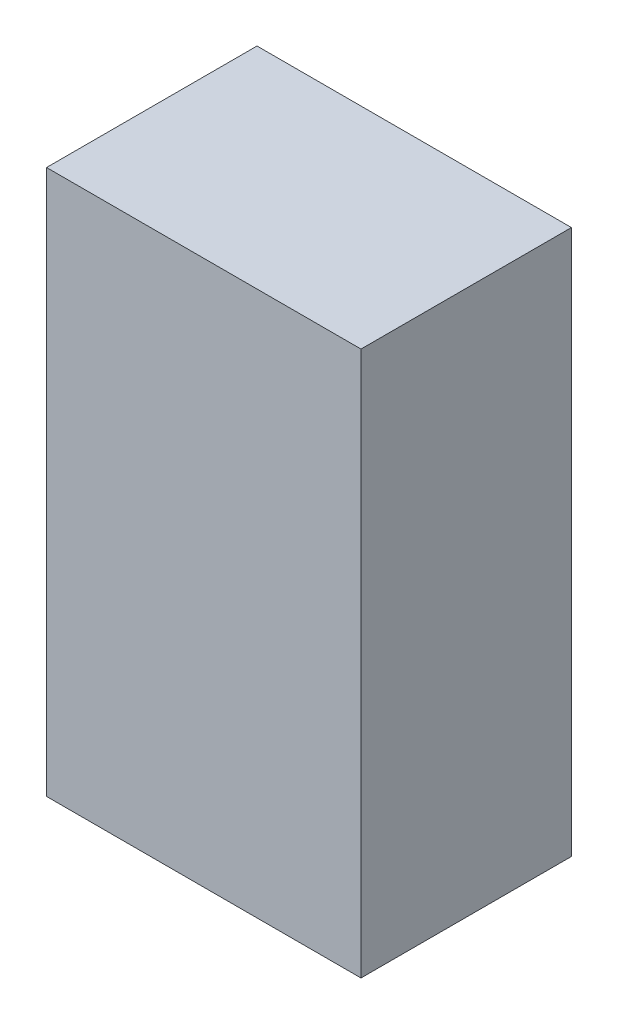
ISO-10303-21;
HEADER;
FILE_DESCRIPTION(('STEP AP214'),'2;1');
FILE_NAME('part.step','',(''),(''),'','','');
FILE_SCHEMA(('AUTOMOTIVE_DESIGN { 1 0 10303 214 1 1 1 1 }'));
ENDSEC;
DATA;
#1=APPLICATION_CONTEXT('core data for automotive mechanical design processes');
#2=APPLICATION_PROTOCOL_DEFINITION('international standard','automotive_design',2000,#1);
#3=PRODUCT_CONTEXT('',#1,'mechanical');
#4=PRODUCT('Part','Part','',(#3));
#5=PRODUCT_RELATED_PRODUCT_CATEGORY('part','',(#4));
#6=PRODUCT_DEFINITION_FORMATION('','',#4);
#7=PRODUCT_DEFINITION_CONTEXT('part definition',#1,'design');
#8=PRODUCT_DEFINITION('design','',#6,#7);
#9=PRODUCT_DEFINITION_SHAPE('','',#8);
#10=(LENGTH_UNIT() NAMED_UNIT(*) SI_UNIT(.MILLI.,.METRE.));
#11=(NAMED_UNIT(*) PLANE_ANGLE_UNIT() SI_UNIT($,.RADIAN.));
#12=(NAMED_UNIT(*) SI_UNIT($,.STERADIAN.) SOLID_ANGLE_UNIT());
#13=UNCERTAINTY_MEASURE_WITH_UNIT(LENGTH_MEASURE(1.E-05),#10,'distance_accuracy_value','');
#14=(GEOMETRIC_REPRESENTATION_CONTEXT(3) GLOBAL_UNCERTAINTY_ASSIGNED_CONTEXT((#13)) GLOBAL_UNIT_ASSIGNED_CONTEXT((#10,
#11,#12)) REPRESENTATION_CONTEXT('',''));
#15=CARTESIAN_POINT('',(0.,0.,0.));
#16=DIRECTION('',(0.,0.,1.));
#17=DIRECTION('',(1.,0.,0.));
#18=AXIS2_PLACEMENT_3D('',#15,#16,#17);
#19=CARTESIAN_POINT('',(0.635,-1.10000034,0.85));
#20=DIRECTION('',(0.,0.,1.));
#21=DIRECTION('',(1.,0.,0.));
#22=AXIS2_PLACEMENT_3D('',#19,#20,#21);
#23=PLANE('',#22);
#24=DIRECTION('',(0.,1.,0.));
#25=VECTOR('',#24,1.);
#26=CARTESIAN_POINT('',(-0.635,-1.10000034,0.85));
#27=LINE('',#26,#25);
#28=CARTESIAN_POINT('',(-0.635,-1.10000034,0.85));
#29=VERTEX_POINT('',#28);
#30=CARTESIAN_POINT('',(-0.635,1.10000034,0.85));
#31=VERTEX_POINT('',#30);
#32=EDGE_CURVE('E53',#29,#31,#27,.T.);
#33=ORIENTED_EDGE('',*,*,#32,.F.);
#34=DIRECTION('',(1.,0.,0.));
#35=VECTOR('',#34,1.);
#36=CARTESIAN_POINT('',(0.635,-1.10000034,0.85));
#37=LINE('',#36,#35);
#38=CARTESIAN_POINT('',(0.635,-1.10000034,0.85));
#39=VERTEX_POINT('',#38);
#40=EDGE_CURVE('E20',#29,#39,#37,.T.);
#41=ORIENTED_EDGE('',*,*,#40,.T.);
#42=DIRECTION('',(0.,1.,0.));
#43=VECTOR('',#42,1.);
#44=CARTESIAN_POINT('',(0.635,1.10000034,0.85));
#45=LINE('',#44,#43);
#46=CARTESIAN_POINT('',(0.635,1.10000034,0.85));
#47=VERTEX_POINT('',#46);
#48=EDGE_CURVE('E67',#47,#39,#45,.F.);
#49=ORIENTED_EDGE('',*,*,#48,.F.);
#50=DIRECTION('',(1.,0.,0.));
#51=VECTOR('',#50,1.);
#52=CARTESIAN_POINT('',(-0.635,1.10000034,0.85));
#53=LINE('',#52,#51);
#54=EDGE_CURVE('E58',#31,#47,#53,.T.);
#55=ORIENTED_EDGE('',*,*,#54,.F.);
#56=EDGE_LOOP('',(#33,#41,#49,#55));
#57=FACE_BOUND('',#56,.T.);
#58=ADVANCED_FACE('F17',(#57),#23,.T.);
#59=CARTESIAN_POINT('',(0.635,1.10000034,0.));
#60=DIRECTION('',(1.,0.,0.));
#61=DIRECTION('',(0.,0.,-1.));
#62=AXIS2_PLACEMENT_3D('',#59,#60,#61);
#63=PLANE('',#62);
#64=DIRECTION('',(0.,0.,-1.));
#65=VECTOR('',#64,1.);
#66=CARTESIAN_POINT('',(0.635,-1.10000034,0.));
#67=LINE('',#66,#65);
#68=CARTESIAN_POINT('',(0.635,-1.10000034,0.));
#69=VERTEX_POINT('',#68);
#70=EDGE_CURVE('E80',#69,#39,#67,.F.);
#71=ORIENTED_EDGE('',*,*,#70,.F.);
#72=DIRECTION('',(0.,1.,0.));
#73=VECTOR('',#72,1.);
#74=CARTESIAN_POINT('',(0.635,-1.10000034,0.));
#75=LINE('',#74,#73);
#76=CARTESIAN_POINT('',(0.635,1.10000034,0.));
#77=VERTEX_POINT('',#76);
#78=EDGE_CURVE('E75',#69,#77,#75,.T.);
#79=ORIENTED_EDGE('',*,*,#78,.T.);
#80=DIRECTION('',(0.,0.,1.));
#81=VECTOR('',#80,1.);
#82=CARTESIAN_POINT('',(0.635,1.10000034,0.));
#83=LINE('',#82,#81);
#84=EDGE_CURVE('E63',#47,#77,#83,.F.);
#85=ORIENTED_EDGE('',*,*,#84,.F.);
#86=ORIENTED_EDGE('',*,*,#48,.T.);
#87=EDGE_LOOP('',(#71,#79,#85,#86));
#88=FACE_BOUND('',#87,.T.);
#89=ADVANCED_FACE('F74',(#88),#63,.T.);
#90=CARTESIAN_POINT('',(-0.635,1.10000034,0.));
#91=DIRECTION('',(0.,1.,0.));
#92=DIRECTION('',(0.,0.,1.));
#93=AXIS2_PLACEMENT_3D('',#90,#91,#92);
#94=PLANE('',#93);
#95=ORIENTED_EDGE('',*,*,#84,.T.);
#96=DIRECTION('',(1.,0.,0.));
#97=VECTOR('',#96,1.);
#98=CARTESIAN_POINT('',(0.635,1.10000034,0.));
#99=LINE('',#98,#97);
#100=CARTESIAN_POINT('',(-0.635,1.10000034,0.));
#101=VERTEX_POINT('',#100);
#102=EDGE_CURVE('E84',#77,#101,#99,.F.);
#103=ORIENTED_EDGE('',*,*,#102,.T.);
#104=DIRECTION('',(0.,0.,1.));
#105=VECTOR('',#104,1.);
#106=CARTESIAN_POINT('',(-0.635,1.10000034,0.));
#107=LINE('',#106,#105);
#108=EDGE_CURVE('E65',#31,#101,#107,.F.);
#109=ORIENTED_EDGE('',*,*,#108,.F.);
#110=ORIENTED_EDGE('',*,*,#54,.T.);
#111=EDGE_LOOP('',(#95,#103,#109,#110));
#112=FACE_BOUND('',#111,.T.);
#113=ADVANCED_FACE('F60',(#112),#94,.T.);
#114=CARTESIAN_POINT('',(-0.635,-1.10000034,0.));
#115=DIRECTION('',(-1.,0.,0.));
#116=DIRECTION('',(0.,0.,1.));
#117=AXIS2_PLACEMENT_3D('',#114,#115,#116);
#118=PLANE('',#117);
#119=ORIENTED_EDGE('',*,*,#108,.T.);
#120=DIRECTION('',(0.,1.,0.));
#121=VECTOR('',#120,1.);
#122=CARTESIAN_POINT('',(-0.635,-1.10000034,0.));
#123=LINE('',#122,#121);
#124=CARTESIAN_POINT('',(-0.635,-1.10000034,0.));
#125=VERTEX_POINT('',#124);
#126=EDGE_CURVE('E26',#101,#125,#123,.F.);
#127=ORIENTED_EDGE('',*,*,#126,.T.);
#128=DIRECTION('',(0.,0.,-1.));
#129=VECTOR('',#128,1.);
#130=CARTESIAN_POINT('',(-0.635,-1.10000034,0.));
#131=LINE('',#130,#129);
#132=EDGE_CURVE('E34',#29,#125,#131,.T.);
#133=ORIENTED_EDGE('',*,*,#132,.F.);
#134=ORIENTED_EDGE('',*,*,#32,.T.);
#135=EDGE_LOOP('',(#119,#127,#133,#134));
#136=FACE_BOUND('',#135,.T.);
#137=ADVANCED_FACE('F88',(#136),#118,.T.);
#138=CARTESIAN_POINT('',(0.635,-1.10000034,0.));
#139=DIRECTION('',(0.,-1.,0.));
#140=DIRECTION('',(0.,0.,-1.));
#141=AXIS2_PLACEMENT_3D('',#138,#139,#140);
#142=PLANE('',#141);
#143=ORIENTED_EDGE('',*,*,#132,.T.);
#144=DIRECTION('',(1.,0.,0.));
#145=VECTOR('',#144,1.);
#146=CARTESIAN_POINT('',(0.635,-1.10000034,0.));
#147=LINE('',#146,#145);
#148=EDGE_CURVE('E11',#125,#69,#147,.T.);
#149=ORIENTED_EDGE('',*,*,#148,.T.);
#150=ORIENTED_EDGE('',*,*,#70,.T.);
#151=ORIENTED_EDGE('',*,*,#40,.F.);
#152=EDGE_LOOP('',(#143,#149,#150,#151));
#153=FACE_BOUND('',#152,.T.);
#154=ADVANCED_FACE('F91',(#153),#142,.T.);
#155=CARTESIAN_POINT('',(0.635,-1.10000034,0.));
#156=DIRECTION('',(0.,0.,1.));
#157=DIRECTION('',(1.,0.,0.));
#158=AXIS2_PLACEMENT_3D('',#155,#156,#157);
#159=PLANE('',#158);
#160=ORIENTED_EDGE('',*,*,#126,.F.);
#161=ORIENTED_EDGE('',*,*,#102,.F.);
#162=ORIENTED_EDGE('',*,*,#78,.F.);
#163=ORIENTED_EDGE('',*,*,#148,.F.);
#164=EDGE_LOOP('',(#160,#161,#162,#163));
#165=FACE_BOUND('',#164,.T.);
#166=ADVANCED_FACE('F90',(#165),#159,.F.);
#167=CLOSED_SHELL('',(#58,#89,#113,#137,#154,#166));
#168=MANIFOLD_SOLID_BREP('B1',#167);
#169=ADVANCED_BREP_SHAPE_REPRESENTATION('',(#18,#168),#14);
#170=SHAPE_DEFINITION_REPRESENTATION(#9,#169);
ENDSEC;
END-ISO-10303-21;
